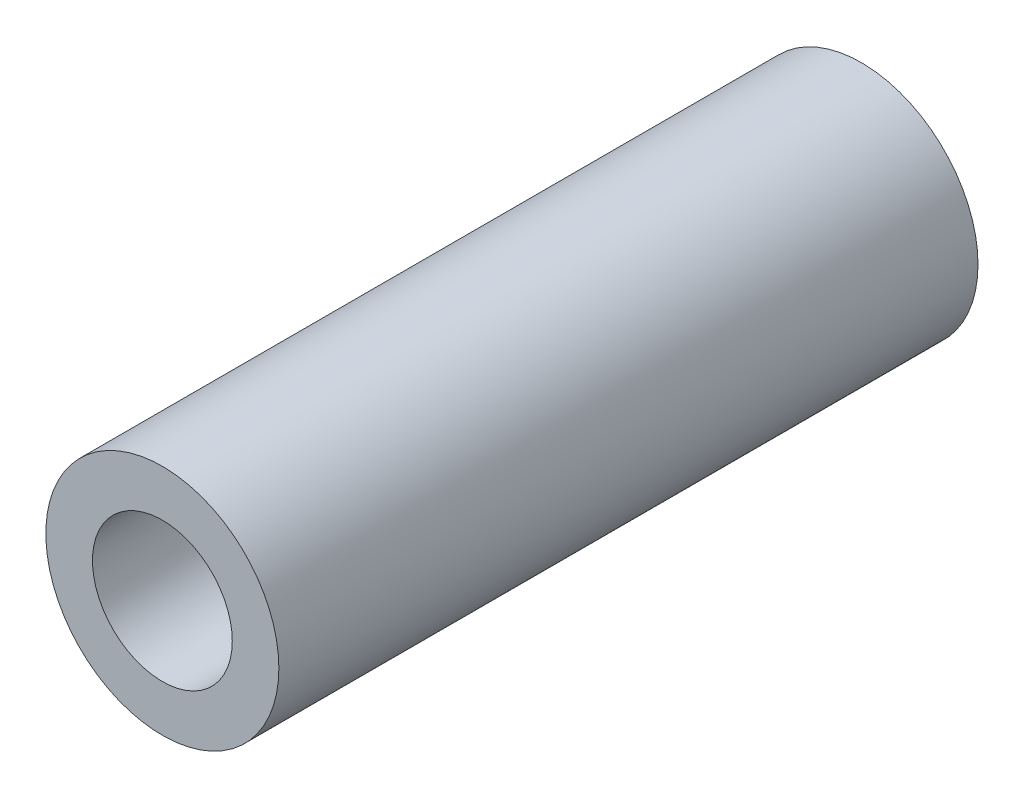
ISO-10303-21;
HEADER;
FILE_DESCRIPTION(('STEP AP214'),'2;1');
FILE_NAME('part.step','',(''),(''),'','','');
FILE_SCHEMA(('AUTOMOTIVE_DESIGN { 1 0 10303 214 1 1 1 1 }'));
ENDSEC;
DATA;
#1=APPLICATION_CONTEXT('core data for automotive mechanical design processes');
#2=APPLICATION_PROTOCOL_DEFINITION('international standard','automotive_design',2000,#1);
#3=PRODUCT_CONTEXT('',#1,'mechanical');
#4=PRODUCT('Part','Part','',(#3));
#5=PRODUCT_RELATED_PRODUCT_CATEGORY('part','',(#4));
#6=PRODUCT_DEFINITION_FORMATION('','',#4);
#7=PRODUCT_DEFINITION_CONTEXT('part definition',#1,'design');
#8=PRODUCT_DEFINITION('design','',#6,#7);
#9=PRODUCT_DEFINITION_SHAPE('','',#8);
#10=(LENGTH_UNIT() NAMED_UNIT(*) SI_UNIT(.MILLI.,.METRE.));
#11=(NAMED_UNIT(*) PLANE_ANGLE_UNIT() SI_UNIT($,.RADIAN.));
#12=(NAMED_UNIT(*) SI_UNIT($,.STERADIAN.) SOLID_ANGLE_UNIT());
#13=UNCERTAINTY_MEASURE_WITH_UNIT(LENGTH_MEASURE(1.E-05),#10,'distance_accuracy_value','');
#14=(GEOMETRIC_REPRESENTATION_CONTEXT(3) GLOBAL_UNCERTAINTY_ASSIGNED_CONTEXT((#13)) GLOBAL_UNIT_ASSIGNED_CONTEXT((#10,
#11,#12)) REPRESENTATION_CONTEXT('',''));
#15=CARTESIAN_POINT('',(0.,0.,0.));
#16=DIRECTION('',(0.,0.,1.));
#17=DIRECTION('',(1.,0.,0.));
#18=AXIS2_PLACEMENT_3D('',#15,#16,#17);
#19=CARTESIAN_POINT('',(0.,0.,25.4));
#20=DIRECTION('',(0.,0.,-1.));
#21=DIRECTION('',(-1.,0.,0.));
#22=AXIS2_PLACEMENT_3D('',#19,#20,#21);
#23=CYLINDRICAL_SURFACE('',#22,7.9375);
#24=CARTESIAN_POINT('',(0.,0.,-25.4));
#25=DIRECTION('',(0.,0.,1.));
#26=DIRECTION('',(1.,0.,0.));
#27=AXIS2_PLACEMENT_3D('',#24,#25,#26);
#28=CIRCLE('',#27,7.9375);
#29=CARTESIAN_POINT('',(7.9375,0.,-25.4));
#30=VERTEX_POINT('',#29);
#31=EDGE_CURVE('E10',#30,#30,#28,.T.);
#32=ORIENTED_EDGE('',*,*,#31,.T.);
#33=EDGE_LOOP('',(#32));
#34=FACE_BOUND('',#33,.T.);
#35=CARTESIAN_POINT('',(0.,0.,22.225));
#36=DIRECTION('',(0.,0.,1.));
#37=DIRECTION('',(1.,0.,0.));
#38=AXIS2_PLACEMENT_3D('',#35,#36,#37);
#39=CIRCLE('',#38,7.9375);
#40=CARTESIAN_POINT('',(7.9375,0.,22.225));
#41=VERTEX_POINT('',#40);
#42=EDGE_CURVE('E43',#41,#41,#39,.T.);
#43=ORIENTED_EDGE('',*,*,#42,.F.);
#44=EDGE_LOOP('',(#43));
#45=FACE_BOUND('',#44,.T.);
#46=ADVANCED_FACE('F37',(#34,#45),#23,.T.);
#47=CARTESIAN_POINT('',(0.,0.,-25.4));
#48=DIRECTION('',(0.,0.,1.));
#49=DIRECTION('',(1.,0.,0.));
#50=AXIS2_PLACEMENT_3D('',#47,#48,#49);
#51=PLANE('',#50);
#52=CARTESIAN_POINT('',(0.,0.,-25.4));
#53=DIRECTION('',(0.,0.,1.));
#54=DIRECTION('',(1.,0.,0.));
#55=AXIS2_PLACEMENT_3D('',#52,#53,#54);
#56=CIRCLE('',#55,4.7625);
#57=CARTESIAN_POINT('',(4.7625,0.,-25.4));
#58=VERTEX_POINT('',#57);
#59=EDGE_CURVE('E47',#58,#58,#56,.T.);
#60=ORIENTED_EDGE('',*,*,#59,.T.);
#61=EDGE_LOOP('',(#60));
#62=FACE_BOUND('',#61,.T.);
#63=ORIENTED_EDGE('',*,*,#31,.F.);
#64=EDGE_LOOP('',(#63));
#65=FACE_BOUND('',#64,.T.);
#66=ADVANCED_FACE('F61',(#62,#65),#51,.F.);
#67=CARTESIAN_POINT('',(0.,0.,22.225));
#68=DIRECTION('',(0.,0.,1.));
#69=DIRECTION('',(1.,0.,0.));
#70=AXIS2_PLACEMENT_3D('',#67,#68,#69);
#71=PLANE('',#70);
#72=CARTESIAN_POINT('',(0.,0.,22.225));
#73=DIRECTION('',(0.,0.,1.));
#74=DIRECTION('',(1.,0.,0.));
#75=AXIS2_PLACEMENT_3D('',#72,#73,#74);
#76=CIRCLE('',#75,4.7625);
#77=CARTESIAN_POINT('',(4.7625,0.,22.225));
#78=VERTEX_POINT('',#77);
#79=EDGE_CURVE('E51',#78,#78,#76,.T.);
#80=ORIENTED_EDGE('',*,*,#79,.F.);
#81=EDGE_LOOP('',(#80));
#82=FACE_BOUND('',#81,.T.);
#83=ORIENTED_EDGE('',*,*,#42,.T.);
#84=EDGE_LOOP('',(#83));
#85=FACE_BOUND('',#84,.T.);
#86=ADVANCED_FACE('F59',(#82,#85),#71,.T.);
#87=CARTESIAN_POINT('',(0.,0.,-25.4));
#88=DIRECTION('',(0.,0.,1.));
#89=DIRECTION('',(1.,0.,0.));
#90=AXIS2_PLACEMENT_3D('',#87,#88,#89);
#91=CYLINDRICAL_SURFACE('',#90,4.7625);
#92=ORIENTED_EDGE('',*,*,#59,.F.);
#93=EDGE_LOOP('',(#92));
#94=FACE_BOUND('',#93,.T.);
#95=ORIENTED_EDGE('',*,*,#79,.T.);
#96=EDGE_LOOP('',(#95));
#97=FACE_BOUND('',#96,.T.);
#98=ADVANCED_FACE('F57',(#94,#97),#91,.F.);
#99=CLOSED_SHELL('',(#46,#66,#86,#98));
#100=MANIFOLD_SOLID_BREP('B2',#99);
#101=ADVANCED_BREP_SHAPE_REPRESENTATION('',(#18,#100),#14);
#102=SHAPE_DEFINITION_REPRESENTATION(#9,#101);
ENDSEC;
END-ISO-10303-21;
